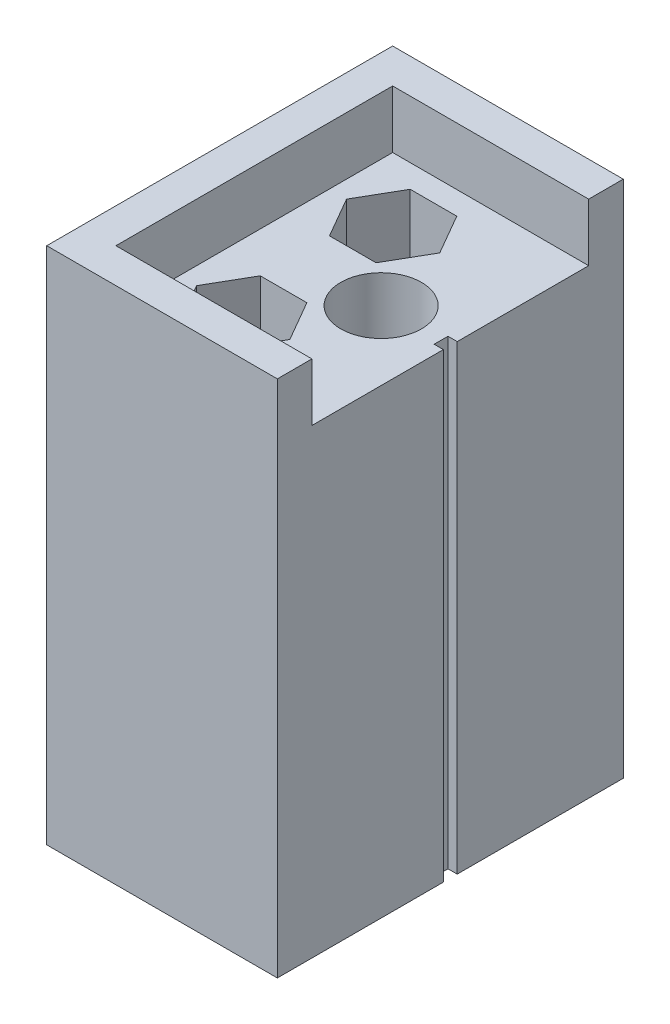
ISO-10303-21;
HEADER;
FILE_DESCRIPTION(('STEP AP214'),'2;1');
FILE_NAME('part.step','',(''),(''),'','','');
FILE_SCHEMA(('AUTOMOTIVE_DESIGN { 1 0 10303 214 1 1 1 1 }'));
ENDSEC;
DATA;
#1=APPLICATION_CONTEXT('core data for automotive mechanical design processes');
#2=APPLICATION_PROTOCOL_DEFINITION('international standard','automotive_design',2000,#1);
#3=PRODUCT_CONTEXT('',#1,'mechanical');
#4=PRODUCT('Part','Part','',(#3));
#5=PRODUCT_RELATED_PRODUCT_CATEGORY('part','',(#4));
#6=PRODUCT_DEFINITION_FORMATION('','',#4);
#7=PRODUCT_DEFINITION_CONTEXT('part definition',#1,'design');
#8=PRODUCT_DEFINITION('design','',#6,#7);
#9=PRODUCT_DEFINITION_SHAPE('','',#8);
#10=(LENGTH_UNIT() NAMED_UNIT(*) SI_UNIT(.MILLI.,.METRE.));
#11=(NAMED_UNIT(*) PLANE_ANGLE_UNIT() SI_UNIT($,.RADIAN.));
#12=(NAMED_UNIT(*) SI_UNIT($,.STERADIAN.) SOLID_ANGLE_UNIT());
#13=UNCERTAINTY_MEASURE_WITH_UNIT(LENGTH_MEASURE(1.E-05),#10,'distance_accuracy_value','');
#14=(GEOMETRIC_REPRESENTATION_CONTEXT(3) GLOBAL_UNCERTAINTY_ASSIGNED_CONTEXT((#13)) GLOBAL_UNIT_ASSIGNED_CONTEXT((#10,
#11,#12)) REPRESENTATION_CONTEXT('',''));
#15=CARTESIAN_POINT('',(0.,0.,0.));
#16=DIRECTION('',(0.,0.,1.));
#17=DIRECTION('',(1.,0.,0.));
#18=AXIS2_PLACEMENT_3D('',#15,#16,#17);
#19=CARTESIAN_POINT('',(20.,40.,0.));
#20=DIRECTION('',(-1.,0.,0.));
#21=DIRECTION('',(0.,0.,1.));
#22=AXIS2_PLACEMENT_3D('',#19,#20,#21);
#23=PLANE('',#22);
#24=DIRECTION('',(0.,0.,-1.));
#25=VECTOR('',#24,1.);
#26=CARTESIAN_POINT('',(20.,0.,0.));
#27=LINE('',#26,#25);
#28=CARTESIAN_POINT('',(20.,0.,0.));
#29=VERTEX_POINT('',#28);
#30=CARTESIAN_POINT('',(20.,0.,-14.4));
#31=VERTEX_POINT('',#30);
#32=EDGE_CURVE('E410',#29,#31,#27,.T.);
#33=ORIENTED_EDGE('',*,*,#32,.T.);
#34=DIRECTION('',(0.,-1.,0.));
#35=VECTOR('',#34,1.);
#36=CARTESIAN_POINT('',(20.,40.,-14.4));
#37=LINE('',#36,#35);
#38=CARTESIAN_POINT('',(20.,40.,-14.4));
#39=VERTEX_POINT('',#38);
#40=EDGE_CURVE('E407',#39,#31,#37,.T.);
#41=ORIENTED_EDGE('',*,*,#40,.F.);
#42=DIRECTION('',(0.,0.,-1.));
#43=VECTOR('',#42,1.);
#44=CARTESIAN_POINT('',(20.,40.,0.));
#45=LINE('',#44,#43);
#46=CARTESIAN_POINT('',(20.,40.,-3.));
#47=VERTEX_POINT('',#46);
#48=EDGE_CURVE('E386',#47,#39,#45,.T.);
#49=ORIENTED_EDGE('',*,*,#48,.F.);
#50=DIRECTION('',(0.,-1.,0.));
#51=VECTOR('',#50,1.);
#52=CARTESIAN_POINT('',(20.,45.,-3.));
#53=LINE('',#52,#51);
#54=CARTESIAN_POINT('',(20.,45.,-3.));
#55=VERTEX_POINT('',#54);
#56=EDGE_CURVE('E375',#55,#47,#53,.T.);
#57=ORIENTED_EDGE('',*,*,#56,.F.);
#58=DIRECTION('',(0.,0.,-1.));
#59=VECTOR('',#58,1.);
#60=CARTESIAN_POINT('',(20.,45.,0.));
#61=LINE('',#60,#59);
#62=CARTESIAN_POINT('',(20.,45.,0.));
#63=VERTEX_POINT('',#62);
#64=EDGE_CURVE('E331',#63,#55,#61,.T.);
#65=ORIENTED_EDGE('',*,*,#64,.F.);
#66=DIRECTION('',(0.,-1.,0.));
#67=VECTOR('',#66,1.);
#68=CARTESIAN_POINT('',(20.,40.,0.));
#69=LINE('',#68,#67);
#70=EDGE_CURVE('E45',#63,#29,#69,.T.);
#71=ORIENTED_EDGE('',*,*,#70,.T.);
#72=EDGE_LOOP('',(#33,#41,#49,#57,#65,#71));
#73=FACE_BOUND('',#72,.T.);
#74=ADVANCED_FACE('F35',(#73),#23,.F.);
#75=CARTESIAN_POINT('',(0.,40.,0.));
#76=DIRECTION('',(0.,-1.,0.));
#77=DIRECTION('',(0.,0.,-1.));
#78=AXIS2_PLACEMENT_3D('',#75,#76,#77);
#79=PLANE('',#78);
#80=ORIENTED_EDGE('',*,*,#48,.T.);
#81=DIRECTION('',(1.,0.,0.));
#82=VECTOR('',#81,1.);
#83=CARTESIAN_POINT('',(19.2,40.,-14.4));
#84=LINE('',#83,#82);
#85=CARTESIAN_POINT('',(19.2,40.,-14.4));
#86=VERTEX_POINT('',#85);
#87=EDGE_CURVE('E222',#86,#39,#84,.T.);
#88=ORIENTED_EDGE('',*,*,#87,.F.);
#89=DIRECTION('',(0.,0.,1.));
#90=VECTOR('',#89,1.);
#91=CARTESIAN_POINT('',(19.2,40.,-14.4));
#92=LINE('',#91,#90);
#93=CARTESIAN_POINT('',(19.2,40.,-15.6));
#94=VERTEX_POINT('',#93);
#95=EDGE_CURVE('E207',#94,#86,#92,.T.);
#96=ORIENTED_EDGE('',*,*,#95,.F.);
#97=DIRECTION('',(1.,0.,0.));
#98=VECTOR('',#97,1.);
#99=CARTESIAN_POINT('',(19.2,40.,-15.6));
#100=LINE('',#99,#98);
#101=CARTESIAN_POINT('',(20.,40.,-15.6));
#102=VERTEX_POINT('',#101);
#103=EDGE_CURVE('E205',#94,#102,#100,.T.);
#104=ORIENTED_EDGE('',*,*,#103,.T.);
#105=CARTESIAN_POINT('',(20.,40.,-27.));
#106=VERTEX_POINT('',#105);
#107=EDGE_CURVE('E39',#102,#106,#45,.T.);
#108=ORIENTED_EDGE('',*,*,#107,.T.);
#109=DIRECTION('',(1.,0.,0.));
#110=VECTOR('',#109,1.);
#111=CARTESIAN_POINT('',(3.,40.,-27.));
#112=LINE('',#111,#110);
#113=CARTESIAN_POINT('',(3.,40.,-27.));
#114=VERTEX_POINT('',#113);
#115=EDGE_CURVE('E332',#114,#106,#112,.T.);
#116=ORIENTED_EDGE('',*,*,#115,.F.);
#117=DIRECTION('',(0.,0.,-1.));
#118=VECTOR('',#117,1.);
#119=CARTESIAN_POINT('',(3.,40.,-3.));
#120=LINE('',#119,#118);
#121=CARTESIAN_POINT('',(3.,40.,-3.));
#122=VERTEX_POINT('',#121);
#123=EDGE_CURVE('E350',#122,#114,#120,.T.);
#124=ORIENTED_EDGE('',*,*,#123,.F.);
#125=DIRECTION('',(-1.,0.,0.));
#126=VECTOR('',#125,1.);
#127=CARTESIAN_POINT('',(20.,40.,-3.));
#128=LINE('',#127,#126);
#129=EDGE_CURVE('E325',#47,#122,#128,.T.);
#130=ORIENTED_EDGE('',*,*,#129,.F.);
#131=EDGE_LOOP('',(#80,#88,#96,#104,#108,#116,#124,#130));
#132=FACE_BOUND('',#131,.T.);
#133=DIRECTION('',(-0.5,0.,-0.866025403784439));
#134=VECTOR('',#133,1.);
#135=CARTESIAN_POINT('',(12.5829037686548,40.,-8.5));
#136=LINE('',#135,#134);
#137=CARTESIAN_POINT('',(12.5829037686548,40.,-8.5));
#138=VERTEX_POINT('',#137);
#139=CARTESIAN_POINT('',(10.5621778264911,40.,-12.));
#140=VERTEX_POINT('',#139);
#141=EDGE_CURVE('E248',#138,#140,#136,.T.);
#142=ORIENTED_EDGE('',*,*,#141,.F.);
#143=DIRECTION('',(0.5,0.,-0.866025403784439));
#144=VECTOR('',#143,1.);
#145=CARTESIAN_POINT('',(10.5621778264911,40.,-5.));
#146=LINE('',#145,#144);
#147=CARTESIAN_POINT('',(10.5621778264911,40.,-5.));
#148=VERTEX_POINT('',#147);
#149=EDGE_CURVE('E61',#148,#138,#146,.T.);
#150=ORIENTED_EDGE('',*,*,#149,.F.);
#151=DIRECTION('',(1.,0.,0.));
#152=VECTOR('',#151,1.);
#153=CARTESIAN_POINT('',(6.5207259421637,40.,-5.));
#154=LINE('',#153,#152);
#155=CARTESIAN_POINT('',(6.5207259421637,40.,-5.));
#156=VERTEX_POINT('',#155);
#157=EDGE_CURVE('E231',#156,#148,#154,.T.);
#158=ORIENTED_EDGE('',*,*,#157,.F.);
#159=DIRECTION('',(0.5,0.,0.866025403784438));
#160=VECTOR('',#159,1.);
#161=CARTESIAN_POINT('',(4.5,40.,-8.5));
#162=LINE('',#161,#160);
#163=CARTESIAN_POINT('',(4.5,40.,-8.5));
#164=VERTEX_POINT('',#163);
#165=EDGE_CURVE('E257',#164,#156,#162,.T.);
#166=ORIENTED_EDGE('',*,*,#165,.F.);
#167=DIRECTION('',(-0.5,0.,0.866025403784439));
#168=VECTOR('',#167,1.);
#169=CARTESIAN_POINT('',(6.5207259421637,40.,-12.));
#170=LINE('',#169,#168);
#171=CARTESIAN_POINT('',(6.5207259421637,40.,-12.));
#172=VERTEX_POINT('',#171);
#173=EDGE_CURVE('E254',#172,#164,#170,.T.);
#174=ORIENTED_EDGE('',*,*,#173,.F.);
#175=DIRECTION('',(-1.,0.,0.));
#176=VECTOR('',#175,1.);
#177=CARTESIAN_POINT('',(10.5621778264911,40.,-12.));
#178=LINE('',#177,#176);
#179=EDGE_CURVE('E251',#140,#172,#178,.T.);
#180=ORIENTED_EDGE('',*,*,#179,.F.);
#181=EDGE_LOOP('',(#142,#150,#158,#166,#174,#180));
#182=FACE_BOUND('',#181,.T.);
#183=DIRECTION('',(-0.5,0.,-0.866025403784439));
#184=VECTOR('',#183,1.);
#185=CARTESIAN_POINT('',(12.5829037686548,40.,-21.5));
#186=LINE('',#185,#184);
#187=CARTESIAN_POINT('',(12.5829037686548,40.,-21.5));
#188=VERTEX_POINT('',#187);
#189=CARTESIAN_POINT('',(10.5621778264911,40.,-25.));
#190=VERTEX_POINT('',#189);
#191=EDGE_CURVE('E295',#188,#190,#186,.T.);
#192=ORIENTED_EDGE('',*,*,#191,.F.);
#193=DIRECTION('',(0.5,0.,-0.866025403784438));
#194=VECTOR('',#193,1.);
#195=CARTESIAN_POINT('',(10.5621778264911,40.,-18.));
#196=LINE('',#195,#194);
#197=CARTESIAN_POINT('',(10.5621778264911,40.,-18.));
#198=VERTEX_POINT('',#197);
#199=EDGE_CURVE('E264',#198,#188,#196,.T.);
#200=ORIENTED_EDGE('',*,*,#199,.F.);
#201=DIRECTION('',(1.,0.,0.));
#202=VECTOR('',#201,1.);
#203=CARTESIAN_POINT('',(6.5207259421637,40.,-18.));
#204=LINE('',#203,#202);
#205=CARTESIAN_POINT('',(6.5207259421637,40.,-18.));
#206=VERTEX_POINT('',#205);
#207=EDGE_CURVE('E278',#206,#198,#204,.T.);
#208=ORIENTED_EDGE('',*,*,#207,.F.);
#209=DIRECTION('',(0.5,0.,0.866025403784439));
#210=VECTOR('',#209,1.);
#211=CARTESIAN_POINT('',(4.5,40.,-21.5));
#212=LINE('',#211,#210);
#213=CARTESIAN_POINT('',(4.5,40.,-21.5));
#214=VERTEX_POINT('',#213);
#215=EDGE_CURVE('E304',#214,#206,#212,.T.);
#216=ORIENTED_EDGE('',*,*,#215,.F.);
#217=DIRECTION('',(-0.5,0.,0.866025403784438));
#218=VECTOR('',#217,1.);
#219=CARTESIAN_POINT('',(6.5207259421637,40.,-25.));
#220=LINE('',#219,#218);
#221=CARTESIAN_POINT('',(6.5207259421637,40.,-25.));
#222=VERTEX_POINT('',#221);
#223=EDGE_CURVE('E301',#222,#214,#220,.T.);
#224=ORIENTED_EDGE('',*,*,#223,.F.);
#225=DIRECTION('',(-1.,0.,0.));
#226=VECTOR('',#225,1.);
#227=CARTESIAN_POINT('',(10.5621778264911,40.,-25.));
#228=LINE('',#227,#226);
#229=EDGE_CURVE('E298',#190,#222,#228,.T.);
#230=ORIENTED_EDGE('',*,*,#229,.F.);
#231=EDGE_LOOP('',(#192,#200,#208,#216,#224,#230));
#232=FACE_BOUND('',#231,.T.);
#233=CARTESIAN_POINT('',(14.,40.,-15.));
#234=DIRECTION('',(0.,1.,0.));
#235=DIRECTION('',(0.,0.,1.));
#236=AXIS2_PLACEMENT_3D('',#233,#234,#235);
#237=CIRCLE('',#236,3.5);
#238=CARTESIAN_POINT('',(14.,40.,-11.5));
#239=VERTEX_POINT('',#238);
#240=EDGE_CURVE('E311',#239,#239,#237,.T.);
#241=ORIENTED_EDGE('',*,*,#240,.F.);
#242=EDGE_LOOP('',(#241));
#243=FACE_BOUND('',#242,.T.);
#244=ADVANCED_FACE('F400',(#132,#182,#232,#243),#79,.F.);
#245=CARTESIAN_POINT('',(0.,40.,0.));
#246=DIRECTION('',(1.,0.,0.));
#247=DIRECTION('',(0.,0.,-1.));
#248=AXIS2_PLACEMENT_3D('',#245,#246,#247);
#249=PLANE('',#248);
#250=DIRECTION('',(0.,0.,1.));
#251=VECTOR('',#250,1.);
#252=CARTESIAN_POINT('',(0.,0.,0.));
#253=LINE('',#252,#251);
#254=CARTESIAN_POINT('',(0.,0.,-30.));
#255=VERTEX_POINT('',#254);
#256=CARTESIAN_POINT('',(0.,0.,0.));
#257=VERTEX_POINT('',#256);
#258=EDGE_CURVE('E380',#255,#257,#253,.T.);
#259=ORIENTED_EDGE('',*,*,#258,.T.);
#260=DIRECTION('',(0.,-1.,0.));
#261=VECTOR('',#260,1.);
#262=CARTESIAN_POINT('',(0.,40.,0.));
#263=LINE('',#262,#261);
#264=CARTESIAN_POINT('',(0.,45.,0.));
#265=VERTEX_POINT('',#264);
#266=EDGE_CURVE('E11',#265,#257,#263,.T.);
#267=ORIENTED_EDGE('',*,*,#266,.F.);
#268=DIRECTION('',(0.,0.,1.));
#269=VECTOR('',#268,1.);
#270=CARTESIAN_POINT('',(0.,45.,-30.));
#271=LINE('',#270,#269);
#272=CARTESIAN_POINT('',(0.,45.,-30.));
#273=VERTEX_POINT('',#272);
#274=EDGE_CURVE('E346',#273,#265,#271,.T.);
#275=ORIENTED_EDGE('',*,*,#274,.F.);
#276=DIRECTION('',(0.,-1.,0.));
#277=VECTOR('',#276,1.);
#278=CARTESIAN_POINT('',(0.,40.,-30.));
#279=LINE('',#278,#277);
#280=EDGE_CURVE('E389',#273,#255,#279,.T.);
#281=ORIENTED_EDGE('',*,*,#280,.T.);
#282=EDGE_LOOP('',(#259,#267,#275,#281));
#283=FACE_BOUND('',#282,.T.);
#284=ADVANCED_FACE('F37',(#283),#249,.F.);
#285=CARTESIAN_POINT('',(0.,40.,0.));
#286=DIRECTION('',(0.,0.,-1.));
#287=DIRECTION('',(-1.,0.,0.));
#288=AXIS2_PLACEMENT_3D('',#285,#286,#287);
#289=PLANE('',#288);
#290=DIRECTION('',(1.,0.,0.));
#291=VECTOR('',#290,1.);
#292=CARTESIAN_POINT('',(0.,0.,0.));
#293=LINE('',#292,#291);
#294=EDGE_CURVE('E430',#257,#29,#293,.T.);
#295=ORIENTED_EDGE('',*,*,#294,.T.);
#296=ORIENTED_EDGE('',*,*,#70,.F.);
#297=DIRECTION('',(1.,0.,0.));
#298=VECTOR('',#297,1.);
#299=CARTESIAN_POINT('',(0.,45.,0.));
#300=LINE('',#299,#298);
#301=EDGE_CURVE('E328',#265,#63,#300,.T.);
#302=ORIENTED_EDGE('',*,*,#301,.F.);
#303=ORIENTED_EDGE('',*,*,#266,.T.);
#304=EDGE_LOOP('',(#295,#296,#302,#303));
#305=FACE_BOUND('',#304,.T.);
#306=ADVANCED_FACE('F432',(#305),#289,.F.);
#307=ORIENTED_EDGE('',*,*,#107,.F.);
#308=DIRECTION('',(0.,1.,0.));
#309=VECTOR('',#308,1.);
#310=CARTESIAN_POINT('',(20.,40.,-15.6));
#311=LINE('',#310,#309);
#312=CARTESIAN_POINT('',(20.,0.,-15.6));
#313=VERTEX_POINT('',#312);
#314=EDGE_CURVE('E412',#313,#102,#311,.T.);
#315=ORIENTED_EDGE('',*,*,#314,.F.);
#316=CARTESIAN_POINT('',(20.,0.,-30.));
#317=VERTEX_POINT('',#316);
#318=EDGE_CURVE('E219',#313,#317,#27,.T.);
#319=ORIENTED_EDGE('',*,*,#318,.T.);
#320=DIRECTION('',(0.,-1.,0.));
#321=VECTOR('',#320,1.);
#322=CARTESIAN_POINT('',(20.,40.,-30.));
#323=LINE('',#322,#321);
#324=CARTESIAN_POINT('',(20.,45.,-30.));
#325=VERTEX_POINT('',#324);
#326=EDGE_CURVE('E426',#325,#317,#323,.T.);
#327=ORIENTED_EDGE('',*,*,#326,.F.);
#328=DIRECTION('',(0.,0.,-1.));
#329=VECTOR('',#328,1.);
#330=CARTESIAN_POINT('',(20.,45.,-27.));
#331=LINE('',#330,#329);
#332=CARTESIAN_POINT('',(20.,45.,-27.));
#333=VERTEX_POINT('',#332);
#334=EDGE_CURVE('E340',#333,#325,#331,.T.);
#335=ORIENTED_EDGE('',*,*,#334,.F.);
#336=DIRECTION('',(0.,-1.,0.));
#337=VECTOR('',#336,1.);
#338=CARTESIAN_POINT('',(20.,45.,-27.));
#339=LINE('',#338,#337);
#340=EDGE_CURVE('E349',#333,#106,#339,.T.);
#341=ORIENTED_EDGE('',*,*,#340,.T.);
#342=EDGE_LOOP('',(#307,#315,#319,#327,#335,#341));
#343=FACE_BOUND('',#342,.T.);
#344=ADVANCED_FACE('F417',(#343),#23,.F.);
#345=CARTESIAN_POINT('',(0.,40.,-30.));
#346=DIRECTION('',(0.,0.,1.));
#347=DIRECTION('',(1.,0.,0.));
#348=AXIS2_PLACEMENT_3D('',#345,#346,#347);
#349=PLANE('',#348);
#350=DIRECTION('',(-1.,0.,0.));
#351=VECTOR('',#350,1.);
#352=CARTESIAN_POINT('',(0.,0.,-30.));
#353=LINE('',#352,#351);
#354=EDGE_CURVE('E418',#317,#255,#353,.T.);
#355=ORIENTED_EDGE('',*,*,#354,.T.);
#356=ORIENTED_EDGE('',*,*,#280,.F.);
#357=DIRECTION('',(-1.,0.,0.));
#358=VECTOR('',#357,1.);
#359=CARTESIAN_POINT('',(20.,45.,-30.));
#360=LINE('',#359,#358);
#361=EDGE_CURVE('E343',#325,#273,#360,.T.);
#362=ORIENTED_EDGE('',*,*,#361,.F.);
#363=ORIENTED_EDGE('',*,*,#326,.T.);
#364=EDGE_LOOP('',(#355,#356,#362,#363));
#365=FACE_BOUND('',#364,.T.);
#366=ADVANCED_FACE('F436',(#365),#349,.F.);
#367=CARTESIAN_POINT('',(0.,0.,0.));
#368=DIRECTION('',(0.,-1.,0.));
#369=DIRECTION('',(0.,0.,-1.));
#370=AXIS2_PLACEMENT_3D('',#367,#368,#369);
#371=PLANE('',#370);
#372=DIRECTION('',(1.,0.,0.));
#373=VECTOR('',#372,1.);
#374=CARTESIAN_POINT('',(19.2,0.,-14.4));
#375=LINE('',#374,#373);
#376=CARTESIAN_POINT('',(19.2,0.,-14.4));
#377=VERTEX_POINT('',#376);
#378=EDGE_CURVE('E220',#377,#31,#375,.T.);
#379=ORIENTED_EDGE('',*,*,#378,.T.);
#380=ORIENTED_EDGE('',*,*,#32,.F.);
#381=ORIENTED_EDGE('',*,*,#294,.F.);
#382=ORIENTED_EDGE('',*,*,#258,.F.);
#383=ORIENTED_EDGE('',*,*,#354,.F.);
#384=ORIENTED_EDGE('',*,*,#318,.F.);
#385=DIRECTION('',(1.,0.,0.));
#386=VECTOR('',#385,1.);
#387=CARTESIAN_POINT('',(19.2,0.,-15.6));
#388=LINE('',#387,#386);
#389=CARTESIAN_POINT('',(19.2,0.,-15.6));
#390=VERTEX_POINT('',#389);
#391=EDGE_CURVE('E202',#390,#313,#388,.T.);
#392=ORIENTED_EDGE('',*,*,#391,.F.);
#393=DIRECTION('',(0.,0.,-1.));
#394=VECTOR('',#393,1.);
#395=CARTESIAN_POINT('',(19.2,0.,-14.4));
#396=LINE('',#395,#394);
#397=EDGE_CURVE('E208',#377,#390,#396,.T.);
#398=ORIENTED_EDGE('',*,*,#397,.F.);
#399=EDGE_LOOP('',(#379,#380,#381,#382,#383,#384,#392,#398));
#400=FACE_BOUND('',#399,.T.);
#401=DIRECTION('',(0.5,0.,-0.866025403784439));
#402=VECTOR('',#401,1.);
#403=CARTESIAN_POINT('',(10.5621778264911,0.,-5.));
#404=LINE('',#403,#402);
#405=CARTESIAN_POINT('',(10.5621778264911,0.,-5.));
#406=VERTEX_POINT('',#405);
#407=CARTESIAN_POINT('',(12.5829037686548,0.,-8.5));
#408=VERTEX_POINT('',#407);
#409=EDGE_CURVE('E227',#406,#408,#404,.T.);
#410=ORIENTED_EDGE('',*,*,#409,.T.);
#411=DIRECTION('',(-0.5,0.,-0.866025403784439));
#412=VECTOR('',#411,1.);
#413=CARTESIAN_POINT('',(12.5829037686548,0.,-8.5));
#414=LINE('',#413,#412);
#415=CARTESIAN_POINT('',(10.5621778264911,0.,-12.));
#416=VERTEX_POINT('',#415);
#417=EDGE_CURVE('E230',#408,#416,#414,.T.);
#418=ORIENTED_EDGE('',*,*,#417,.T.);
#419=DIRECTION('',(-1.,0.,0.));
#420=VECTOR('',#419,1.);
#421=CARTESIAN_POINT('',(10.5621778264911,0.,-12.));
#422=LINE('',#421,#420);
#423=CARTESIAN_POINT('',(6.5207259421637,0.,-12.));
#424=VERTEX_POINT('',#423);
#425=EDGE_CURVE('E234',#416,#424,#422,.T.);
#426=ORIENTED_EDGE('',*,*,#425,.T.);
#427=DIRECTION('',(-0.5,0.,0.866025403784439));
#428=VECTOR('',#427,1.);
#429=CARTESIAN_POINT('',(6.5207259421637,0.,-12.));
#430=LINE('',#429,#428);
#431=CARTESIAN_POINT('',(4.5,0.,-8.5));
#432=VERTEX_POINT('',#431);
#433=EDGE_CURVE('E237',#424,#432,#430,.T.);
#434=ORIENTED_EDGE('',*,*,#433,.T.);
#435=DIRECTION('',(0.5,0.,0.866025403784438));
#436=VECTOR('',#435,1.);
#437=CARTESIAN_POINT('',(4.5,0.,-8.5));
#438=LINE('',#437,#436);
#439=CARTESIAN_POINT('',(6.5207259421637,0.,-5.));
#440=VERTEX_POINT('',#439);
#441=EDGE_CURVE('E240',#432,#440,#438,.T.);
#442=ORIENTED_EDGE('',*,*,#441,.T.);
#443=DIRECTION('',(1.,0.,0.));
#444=VECTOR('',#443,1.);
#445=CARTESIAN_POINT('',(6.5207259421637,0.,-5.));
#446=LINE('',#445,#444);
#447=EDGE_CURVE('E243',#440,#406,#446,.T.);
#448=ORIENTED_EDGE('',*,*,#447,.T.);
#449=EDGE_LOOP('',(#410,#418,#426,#434,#442,#448));
#450=FACE_BOUND('',#449,.T.);
#451=DIRECTION('',(0.5,0.,-0.866025403784438));
#452=VECTOR('',#451,1.);
#453=CARTESIAN_POINT('',(10.5621778264911,0.,-18.));
#454=LINE('',#453,#452);
#455=CARTESIAN_POINT('',(10.5621778264911,0.,-18.));
#456=VERTEX_POINT('',#455);
#457=CARTESIAN_POINT('',(12.5829037686548,0.,-21.5));
#458=VERTEX_POINT('',#457);
#459=EDGE_CURVE('E274',#456,#458,#454,.T.);
#460=ORIENTED_EDGE('',*,*,#459,.T.);
#461=DIRECTION('',(-0.5,0.,-0.866025403784439));
#462=VECTOR('',#461,1.);
#463=CARTESIAN_POINT('',(12.5829037686548,0.,-21.5));
#464=LINE('',#463,#462);
#465=CARTESIAN_POINT('',(10.5621778264911,0.,-25.));
#466=VERTEX_POINT('',#465);
#467=EDGE_CURVE('E277',#458,#466,#464,.T.);
#468=ORIENTED_EDGE('',*,*,#467,.T.);
#469=DIRECTION('',(-1.,0.,0.));
#470=VECTOR('',#469,1.);
#471=CARTESIAN_POINT('',(10.5621778264911,0.,-25.));
#472=LINE('',#471,#470);
#473=CARTESIAN_POINT('',(6.5207259421637,0.,-25.));
#474=VERTEX_POINT('',#473);
#475=EDGE_CURVE('E281',#466,#474,#472,.T.);
#476=ORIENTED_EDGE('',*,*,#475,.T.);
#477=DIRECTION('',(-0.5,0.,0.866025403784438));
#478=VECTOR('',#477,1.);
#479=CARTESIAN_POINT('',(6.5207259421637,0.,-25.));
#480=LINE('',#479,#478);
#481=CARTESIAN_POINT('',(4.5,0.,-21.5));
#482=VERTEX_POINT('',#481);
#483=EDGE_CURVE('E284',#474,#482,#480,.T.);
#484=ORIENTED_EDGE('',*,*,#483,.T.);
#485=DIRECTION('',(0.5,0.,0.866025403784439));
#486=VECTOR('',#485,1.);
#487=CARTESIAN_POINT('',(4.5,0.,-21.5));
#488=LINE('',#487,#486);
#489=CARTESIAN_POINT('',(6.5207259421637,0.,-18.));
#490=VERTEX_POINT('',#489);
#491=EDGE_CURVE('E287',#482,#490,#488,.T.);
#492=ORIENTED_EDGE('',*,*,#491,.T.);
#493=DIRECTION('',(1.,0.,0.));
#494=VECTOR('',#493,1.);
#495=CARTESIAN_POINT('',(6.5207259421637,0.,-18.));
#496=LINE('',#495,#494);
#497=EDGE_CURVE('E290',#490,#456,#496,.T.);
#498=ORIENTED_EDGE('',*,*,#497,.T.);
#499=EDGE_LOOP('',(#460,#468,#476,#484,#492,#498));
#500=FACE_BOUND('',#499,.T.);
#501=CARTESIAN_POINT('',(14.,0.,-15.));
#502=DIRECTION('',(0.,1.,0.));
#503=DIRECTION('',(0.,0.,1.));
#504=AXIS2_PLACEMENT_3D('',#501,#502,#503);
#505=CIRCLE('',#504,3.5);
#506=CARTESIAN_POINT('',(14.,0.,-11.5));
#507=VERTEX_POINT('',#506);
#508=EDGE_CURVE('E322',#507,#507,#505,.T.);
#509=ORIENTED_EDGE('',*,*,#508,.T.);
#510=EDGE_LOOP('',(#509));
#511=FACE_BOUND('',#510,.T.);
#512=ADVANCED_FACE('F216',(#400,#450,#500,#511),#371,.T.);
#513=CARTESIAN_POINT('',(20.,45.,-3.));
#514=DIRECTION('',(0.,0.,1.));
#515=DIRECTION('',(1.,0.,0.));
#516=AXIS2_PLACEMENT_3D('',#513,#514,#515);
#517=PLANE('',#516);
#518=ORIENTED_EDGE('',*,*,#129,.T.);
#519=DIRECTION('',(0.,-1.,0.));
#520=VECTOR('',#519,1.);
#521=CARTESIAN_POINT('',(3.,45.,-3.));
#522=LINE('',#521,#520);
#523=CARTESIAN_POINT('',(3.,45.,-3.));
#524=VERTEX_POINT('',#523);
#525=EDGE_CURVE('E370',#524,#122,#522,.T.);
#526=ORIENTED_EDGE('',*,*,#525,.F.);
#527=DIRECTION('',(-1.,0.,0.));
#528=VECTOR('',#527,1.);
#529=CARTESIAN_POINT('',(20.,45.,-3.));
#530=LINE('',#529,#528);
#531=EDGE_CURVE('E334',#55,#524,#530,.T.);
#532=ORIENTED_EDGE('',*,*,#531,.F.);
#533=ORIENTED_EDGE('',*,*,#56,.T.);
#534=EDGE_LOOP('',(#518,#526,#532,#533));
#535=FACE_BOUND('',#534,.T.);
#536=ADVANCED_FACE('F395',(#535),#517,.F.);
#537=CARTESIAN_POINT('',(3.,45.,-3.));
#538=DIRECTION('',(-1.,0.,0.));
#539=DIRECTION('',(0.,0.,1.));
#540=AXIS2_PLACEMENT_3D('',#537,#538,#539);
#541=PLANE('',#540);
#542=ORIENTED_EDGE('',*,*,#123,.T.);
#543=DIRECTION('',(0.,-1.,0.));
#544=VECTOR('',#543,1.);
#545=CARTESIAN_POINT('',(3.,45.,-27.));
#546=LINE('',#545,#544);
#547=CARTESIAN_POINT('',(3.,45.,-27.));
#548=VERTEX_POINT('',#547);
#549=EDGE_CURVE('E355',#548,#114,#546,.T.);
#550=ORIENTED_EDGE('',*,*,#549,.F.);
#551=DIRECTION('',(0.,0.,-1.));
#552=VECTOR('',#551,1.);
#553=CARTESIAN_POINT('',(3.,45.,-3.));
#554=LINE('',#553,#552);
#555=EDGE_CURVE('E336',#524,#548,#554,.T.);
#556=ORIENTED_EDGE('',*,*,#555,.F.);
#557=ORIENTED_EDGE('',*,*,#525,.T.);
#558=EDGE_LOOP('',(#542,#550,#556,#557));
#559=FACE_BOUND('',#558,.T.);
#560=ADVANCED_FACE('F440',(#559),#541,.F.);
#561=CARTESIAN_POINT('',(3.,45.,-27.));
#562=DIRECTION('',(0.,0.,-1.));
#563=DIRECTION('',(-1.,0.,0.));
#564=AXIS2_PLACEMENT_3D('',#561,#562,#563);
#565=PLANE('',#564);
#566=ORIENTED_EDGE('',*,*,#115,.T.);
#567=ORIENTED_EDGE('',*,*,#340,.F.);
#568=DIRECTION('',(1.,0.,0.));
#569=VECTOR('',#568,1.);
#570=CARTESIAN_POINT('',(3.,45.,-27.));
#571=LINE('',#570,#569);
#572=EDGE_CURVE('E338',#548,#333,#571,.T.);
#573=ORIENTED_EDGE('',*,*,#572,.F.);
#574=ORIENTED_EDGE('',*,*,#549,.T.);
#575=EDGE_LOOP('',(#566,#567,#573,#574));
#576=FACE_BOUND('',#575,.T.);
#577=ADVANCED_FACE('F439',(#576),#565,.F.);
#578=CARTESIAN_POINT('',(0.,45.,0.));
#579=DIRECTION('',(0.,1.,0.));
#580=DIRECTION('',(0.,0.,1.));
#581=AXIS2_PLACEMENT_3D('',#578,#579,#580);
#582=PLANE('',#581);
#583=ORIENTED_EDGE('',*,*,#301,.T.);
#584=ORIENTED_EDGE('',*,*,#64,.T.);
#585=ORIENTED_EDGE('',*,*,#531,.T.);
#586=ORIENTED_EDGE('',*,*,#555,.T.);
#587=ORIENTED_EDGE('',*,*,#572,.T.);
#588=ORIENTED_EDGE('',*,*,#334,.T.);
#589=ORIENTED_EDGE('',*,*,#361,.T.);
#590=ORIENTED_EDGE('',*,*,#274,.T.);
#591=EDGE_LOOP('',(#583,#584,#585,#586,#587,#588,#589,#590));
#592=FACE_BOUND('',#591,.T.);
#593=ADVANCED_FACE('F438',(#592),#582,.T.);
#594=CARTESIAN_POINT('',(14.,0.,-15.));
#595=DIRECTION('',(0.,1.,0.));
#596=DIRECTION('',(0.,0.,1.));
#597=AXIS2_PLACEMENT_3D('',#594,#595,#596);
#598=CYLINDRICAL_SURFACE('',#597,3.5);
#599=ORIENTED_EDGE('',*,*,#508,.F.);
#600=EDGE_LOOP('',(#599));
#601=FACE_BOUND('',#600,.T.);
#602=ORIENTED_EDGE('',*,*,#240,.T.);
#603=EDGE_LOOP('',(#602));
#604=FACE_BOUND('',#603,.T.);
#605=ADVANCED_FACE('F563',(#601,#604),#598,.F.);
#606=CARTESIAN_POINT('',(10.5621778264911,0.,-18.));
#607=DIRECTION('',(0.866025403784438,0.,0.5));
#608=DIRECTION('',(0.5,0.,-0.866025403784439));
#609=AXIS2_PLACEMENT_3D('',#606,#607,#608);
#610=PLANE('',#609);
#611=ORIENTED_EDGE('',*,*,#199,.T.);
#612=DIRECTION('',(0.,1.,0.));
#613=VECTOR('',#612,1.);
#614=CARTESIAN_POINT('',(12.5829037686548,0.,-21.5));
#615=LINE('',#614,#613);
#616=EDGE_CURVE('E293',#458,#188,#615,.T.);
#617=ORIENTED_EDGE('',*,*,#616,.F.);
#618=ORIENTED_EDGE('',*,*,#459,.F.);
#619=DIRECTION('',(0.,1.,0.));
#620=VECTOR('',#619,1.);
#621=CARTESIAN_POINT('',(10.5621778264911,0.,-18.));
#622=LINE('',#621,#620);
#623=EDGE_CURVE('E309',#456,#198,#622,.T.);
#624=ORIENTED_EDGE('',*,*,#623,.T.);
#625=EDGE_LOOP('',(#611,#617,#618,#624));
#626=FACE_BOUND('',#625,.T.);
#627=ADVANCED_FACE('F545',(#626),#610,.F.);
#628=CARTESIAN_POINT('',(6.5207259421637,0.,-18.));
#629=DIRECTION('',(0.,0.,1.));
#630=DIRECTION('',(1.,0.,0.));
#631=AXIS2_PLACEMENT_3D('',#628,#629,#630);
#632=PLANE('',#631);
#633=ORIENTED_EDGE('',*,*,#207,.T.);
#634=ORIENTED_EDGE('',*,*,#623,.F.);
#635=ORIENTED_EDGE('',*,*,#497,.F.);
#636=DIRECTION('',(0.,1.,0.));
#637=VECTOR('',#636,1.);
#638=CARTESIAN_POINT('',(6.5207259421637,0.,-18.));
#639=LINE('',#638,#637);
#640=EDGE_CURVE('E312',#490,#206,#639,.T.);
#641=ORIENTED_EDGE('',*,*,#640,.T.);
#642=EDGE_LOOP('',(#633,#634,#635,#641));
#643=FACE_BOUND('',#642,.T.);
#644=ADVANCED_FACE('F541',(#643),#632,.F.);
#645=CARTESIAN_POINT('',(4.5,0.,-21.5));
#646=DIRECTION('',(-0.866025403784439,0.,0.5));
#647=DIRECTION('',(0.5,0.,0.866025403784439));
#648=AXIS2_PLACEMENT_3D('',#645,#646,#647);
#649=PLANE('',#648);
#650=ORIENTED_EDGE('',*,*,#215,.T.);
#651=ORIENTED_EDGE('',*,*,#640,.F.);
#652=ORIENTED_EDGE('',*,*,#491,.F.);
#653=DIRECTION('',(0.,1.,0.));
#654=VECTOR('',#653,1.);
#655=CARTESIAN_POINT('',(4.5,0.,-21.5));
#656=LINE('',#655,#654);
#657=EDGE_CURVE('E314',#482,#214,#656,.T.);
#658=ORIENTED_EDGE('',*,*,#657,.T.);
#659=EDGE_LOOP('',(#650,#651,#652,#658));
#660=FACE_BOUND('',#659,.T.);
#661=ADVANCED_FACE('F544',(#660),#649,.F.);
#662=CARTESIAN_POINT('',(6.5207259421637,0.,-25.));
#663=DIRECTION('',(-0.866025403784439,0.,-0.5));
#664=DIRECTION('',(-0.5,0.,0.866025403784439));
#665=AXIS2_PLACEMENT_3D('',#662,#663,#664);
#666=PLANE('',#665);
#667=ORIENTED_EDGE('',*,*,#223,.T.);
#668=ORIENTED_EDGE('',*,*,#657,.F.);
#669=ORIENTED_EDGE('',*,*,#483,.F.);
#670=DIRECTION('',(0.,1.,0.));
#671=VECTOR('',#670,1.);
#672=CARTESIAN_POINT('',(6.5207259421637,0.,-25.));
#673=LINE('',#672,#671);
#674=EDGE_CURVE('E316',#474,#222,#673,.T.);
#675=ORIENTED_EDGE('',*,*,#674,.T.);
#676=EDGE_LOOP('',(#667,#668,#669,#675));
#677=FACE_BOUND('',#676,.T.);
#678=ADVANCED_FACE('F549',(#677),#666,.F.);
#679=CARTESIAN_POINT('',(10.5621778264911,0.,-25.));
#680=DIRECTION('',(0.,0.,-1.));
#681=DIRECTION('',(-1.,0.,0.));
#682=AXIS2_PLACEMENT_3D('',#679,#680,#681);
#683=PLANE('',#682);
#684=ORIENTED_EDGE('',*,*,#229,.T.);
#685=ORIENTED_EDGE('',*,*,#674,.F.);
#686=ORIENTED_EDGE('',*,*,#475,.F.);
#687=DIRECTION('',(0.,1.,0.));
#688=VECTOR('',#687,1.);
#689=CARTESIAN_POINT('',(10.5621778264911,0.,-25.));
#690=LINE('',#689,#688);
#691=EDGE_CURVE('E318',#466,#190,#690,.T.);
#692=ORIENTED_EDGE('',*,*,#691,.T.);
#693=EDGE_LOOP('',(#684,#685,#686,#692));
#694=FACE_BOUND('',#693,.T.);
#695=ADVANCED_FACE('F553',(#694),#683,.F.);
#696=CARTESIAN_POINT('',(12.5829037686548,0.,-21.5));
#697=DIRECTION('',(0.866025403784439,0.,-0.5));
#698=DIRECTION('',(-0.5,0.,-0.866025403784439));
#699=AXIS2_PLACEMENT_3D('',#696,#697,#698);
#700=PLANE('',#699);
#701=ORIENTED_EDGE('',*,*,#191,.T.);
#702=ORIENTED_EDGE('',*,*,#691,.F.);
#703=ORIENTED_EDGE('',*,*,#467,.F.);
#704=ORIENTED_EDGE('',*,*,#616,.T.);
#705=EDGE_LOOP('',(#701,#702,#703,#704));
#706=FACE_BOUND('',#705,.T.);
#707=ADVANCED_FACE('F540',(#706),#700,.F.);
#708=CARTESIAN_POINT('',(10.5621778264911,0.,-5.));
#709=DIRECTION('',(0.866025403784439,0.,0.5));
#710=DIRECTION('',(0.5,0.,-0.866025403784439));
#711=AXIS2_PLACEMENT_3D('',#708,#709,#710);
#712=PLANE('',#711);
#713=ORIENTED_EDGE('',*,*,#149,.T.);
#714=DIRECTION('',(0.,1.,0.));
#715=VECTOR('',#714,1.);
#716=CARTESIAN_POINT('',(12.5829037686548,0.,-8.5));
#717=LINE('',#716,#715);
#718=EDGE_CURVE('E246',#408,#138,#717,.T.);
#719=ORIENTED_EDGE('',*,*,#718,.F.);
#720=ORIENTED_EDGE('',*,*,#409,.F.);
#721=DIRECTION('',(0.,1.,0.));
#722=VECTOR('',#721,1.);
#723=CARTESIAN_POINT('',(10.5621778264911,0.,-5.));
#724=LINE('',#723,#722);
#725=EDGE_CURVE('E262',#406,#148,#724,.T.);
#726=ORIENTED_EDGE('',*,*,#725,.T.);
#727=EDGE_LOOP('',(#713,#719,#720,#726));
#728=FACE_BOUND('',#727,.T.);
#729=ADVANCED_FACE('F523',(#728),#712,.F.);
#730=CARTESIAN_POINT('',(6.5207259421637,0.,-5.));
#731=DIRECTION('',(0.,0.,1.));
#732=DIRECTION('',(1.,0.,0.));
#733=AXIS2_PLACEMENT_3D('',#730,#731,#732);
#734=PLANE('',#733);
#735=ORIENTED_EDGE('',*,*,#157,.T.);
#736=ORIENTED_EDGE('',*,*,#725,.F.);
#737=ORIENTED_EDGE('',*,*,#447,.F.);
#738=DIRECTION('',(0.,1.,0.));
#739=VECTOR('',#738,1.);
#740=CARTESIAN_POINT('',(6.5207259421637,0.,-5.));
#741=LINE('',#740,#739);
#742=EDGE_CURVE('E265',#440,#156,#741,.T.);
#743=ORIENTED_EDGE('',*,*,#742,.T.);
#744=EDGE_LOOP('',(#735,#736,#737,#743));
#745=FACE_BOUND('',#744,.T.);
#746=ADVANCED_FACE('F519',(#745),#734,.F.);
#747=CARTESIAN_POINT('',(4.5,0.,-8.5));
#748=DIRECTION('',(-0.866025403784439,0.,0.5));
#749=DIRECTION('',(0.5,0.,0.866025403784439));
#750=AXIS2_PLACEMENT_3D('',#747,#748,#749);
#751=PLANE('',#750);
#752=ORIENTED_EDGE('',*,*,#165,.T.);
#753=ORIENTED_EDGE('',*,*,#742,.F.);
#754=ORIENTED_EDGE('',*,*,#441,.F.);
#755=DIRECTION('',(0.,1.,0.));
#756=VECTOR('',#755,1.);
#757=CARTESIAN_POINT('',(4.5,0.,-8.5));
#758=LINE('',#757,#756);
#759=EDGE_CURVE('E267',#432,#164,#758,.T.);
#760=ORIENTED_EDGE('',*,*,#759,.T.);
#761=EDGE_LOOP('',(#752,#753,#754,#760));
#762=FACE_BOUND('',#761,.T.);
#763=ADVANCED_FACE('F522',(#762),#751,.F.);
#764=CARTESIAN_POINT('',(6.5207259421637,0.,-12.));
#765=DIRECTION('',(-0.866025403784439,0.,-0.5));
#766=DIRECTION('',(-0.5,0.,0.866025403784439));
#767=AXIS2_PLACEMENT_3D('',#764,#765,#766);
#768=PLANE('',#767);
#769=ORIENTED_EDGE('',*,*,#173,.T.);
#770=ORIENTED_EDGE('',*,*,#759,.F.);
#771=ORIENTED_EDGE('',*,*,#433,.F.);
#772=DIRECTION('',(0.,1.,0.));
#773=VECTOR('',#772,1.);
#774=CARTESIAN_POINT('',(6.5207259421637,0.,-12.));
#775=LINE('',#774,#773);
#776=EDGE_CURVE('E269',#424,#172,#775,.T.);
#777=ORIENTED_EDGE('',*,*,#776,.T.);
#778=EDGE_LOOP('',(#769,#770,#771,#777));
#779=FACE_BOUND('',#778,.T.);
#780=ADVANCED_FACE('F527',(#779),#768,.F.);
#781=CARTESIAN_POINT('',(10.5621778264911,0.,-12.));
#782=DIRECTION('',(0.,0.,-1.));
#783=DIRECTION('',(-1.,0.,0.));
#784=AXIS2_PLACEMENT_3D('',#781,#782,#783);
#785=PLANE('',#784);
#786=ORIENTED_EDGE('',*,*,#179,.T.);
#787=ORIENTED_EDGE('',*,*,#776,.F.);
#788=ORIENTED_EDGE('',*,*,#425,.F.);
#789=DIRECTION('',(0.,1.,0.));
#790=VECTOR('',#789,1.);
#791=CARTESIAN_POINT('',(10.5621778264911,0.,-12.));
#792=LINE('',#791,#790);
#793=EDGE_CURVE('E271',#416,#140,#792,.T.);
#794=ORIENTED_EDGE('',*,*,#793,.T.);
#795=EDGE_LOOP('',(#786,#787,#788,#794));
#796=FACE_BOUND('',#795,.T.);
#797=ADVANCED_FACE('F531',(#796),#785,.F.);
#798=CARTESIAN_POINT('',(12.5829037686548,0.,-8.5));
#799=DIRECTION('',(0.866025403784439,0.,-0.5));
#800=DIRECTION('',(-0.5,0.,-0.866025403784439));
#801=AXIS2_PLACEMENT_3D('',#798,#799,#800);
#802=PLANE('',#801);
#803=ORIENTED_EDGE('',*,*,#141,.T.);
#804=ORIENTED_EDGE('',*,*,#793,.F.);
#805=ORIENTED_EDGE('',*,*,#417,.F.);
#806=ORIENTED_EDGE('',*,*,#718,.T.);
#807=EDGE_LOOP('',(#803,#804,#805,#806));
#808=FACE_BOUND('',#807,.T.);
#809=ADVANCED_FACE('F497',(#808),#802,.F.);
#810=CARTESIAN_POINT('',(19.2,40.,-14.4));
#811=DIRECTION('',(0.,0.,1.));
#812=DIRECTION('',(0.,-1.,0.));
#813=AXIS2_PLACEMENT_3D('',#810,#811,#812);
#814=PLANE('',#813);
#815=ORIENTED_EDGE('',*,*,#40,.T.);
#816=ORIENTED_EDGE('',*,*,#378,.F.);
#817=DIRECTION('',(0.,-1.,0.));
#818=VECTOR('',#817,1.);
#819=CARTESIAN_POINT('',(19.2,40.,-14.4));
#820=LINE('',#819,#818);
#821=EDGE_CURVE('E53',#86,#377,#820,.T.);
#822=ORIENTED_EDGE('',*,*,#821,.F.);
#823=ORIENTED_EDGE('',*,*,#87,.T.);
#824=EDGE_LOOP('',(#815,#816,#822,#823));
#825=FACE_BOUND('',#824,.T.);
#826=ADVANCED_FACE('F416',(#825),#814,.F.);
#827=CARTESIAN_POINT('',(19.2,40.,-15.6));
#828=DIRECTION('',(0.,0.,-1.));
#829=DIRECTION('',(0.,1.,0.));
#830=AXIS2_PLACEMENT_3D('',#827,#828,#829);
#831=PLANE('',#830);
#832=ORIENTED_EDGE('',*,*,#314,.T.);
#833=ORIENTED_EDGE('',*,*,#103,.F.);
#834=DIRECTION('',(0.,1.,0.));
#835=VECTOR('',#834,1.);
#836=CARTESIAN_POINT('',(19.2,40.,-15.6));
#837=LINE('',#836,#835);
#838=EDGE_CURVE('E199',#390,#94,#837,.T.);
#839=ORIENTED_EDGE('',*,*,#838,.F.);
#840=ORIENTED_EDGE('',*,*,#391,.T.);
#841=EDGE_LOOP('',(#832,#833,#839,#840));
#842=FACE_BOUND('',#841,.T.);
#843=ADVANCED_FACE('F200',(#842),#831,.F.);
#844=CARTESIAN_POINT('',(19.2,0.,0.));
#845=DIRECTION('',(1.,0.,0.));
#846=DIRECTION('',(0.,0.,-1.));
#847=AXIS2_PLACEMENT_3D('',#844,#845,#846);
#848=PLANE('',#847);
#849=ORIENTED_EDGE('',*,*,#821,.T.);
#850=ORIENTED_EDGE('',*,*,#397,.T.);
#851=ORIENTED_EDGE('',*,*,#838,.T.);
#852=ORIENTED_EDGE('',*,*,#95,.T.);
#853=EDGE_LOOP('',(#849,#850,#851,#852));
#854=FACE_BOUND('',#853,.T.);
#855=ADVANCED_FACE('F211',(#854),#848,.T.);
#856=CLOSED_SHELL('',(#74,#244,#284,#306,#344,#366,#512,#536,#560,#577,#593,#605,#627,#644,#661,
#678,#695,#707,#729,#746,#763,#780,#797,#809,#826,#843,#855));
#857=MANIFOLD_SOLID_BREP('B2',#856);
#858=ADVANCED_BREP_SHAPE_REPRESENTATION('',(#18,#857),#14);
#859=SHAPE_DEFINITION_REPRESENTATION(#9,#858);
ENDSEC;
END-ISO-10303-21;
